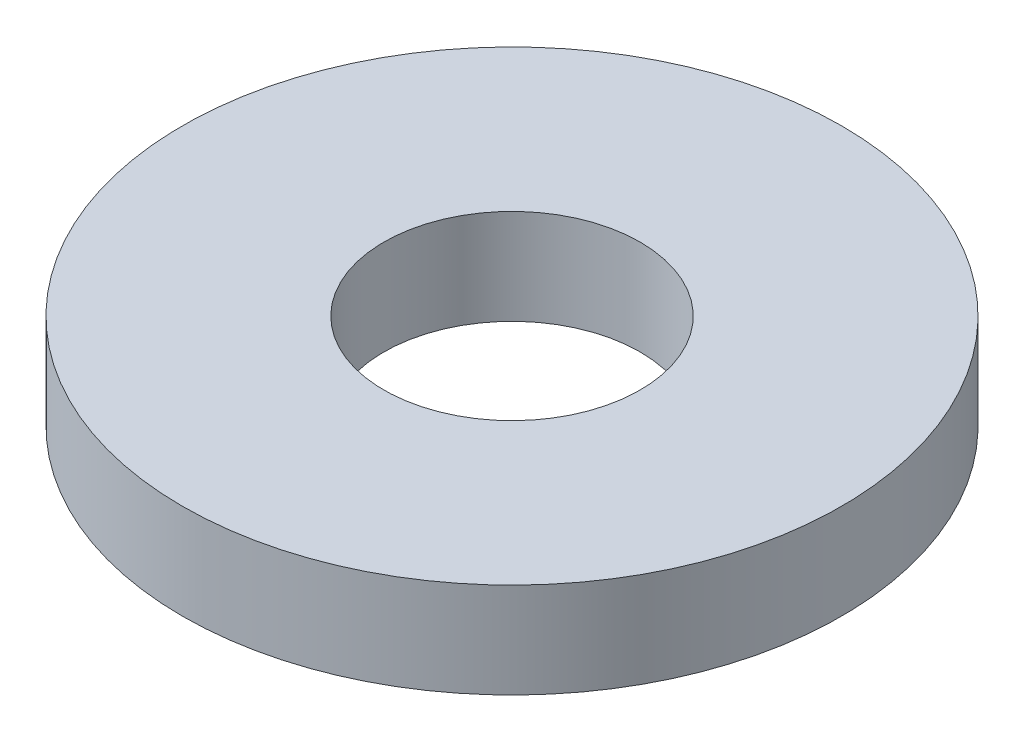
ISO-10303-21;
HEADER;
FILE_DESCRIPTION(('STEP AP214'),'2;1');
FILE_NAME('part.step','',(''),(''),'','','');
FILE_SCHEMA(('AUTOMOTIVE_DESIGN { 1 0 10303 214 1 1 1 1 }'));
ENDSEC;
DATA;
#1=APPLICATION_CONTEXT('core data for automotive mechanical design processes');
#2=APPLICATION_PROTOCOL_DEFINITION('international standard','automotive_design',2000,#1);
#3=PRODUCT_CONTEXT('',#1,'mechanical');
#4=PRODUCT('Part','Part','',(#3));
#5=PRODUCT_RELATED_PRODUCT_CATEGORY('part','',(#4));
#6=PRODUCT_DEFINITION_FORMATION('','',#4);
#7=PRODUCT_DEFINITION_CONTEXT('part definition',#1,'design');
#8=PRODUCT_DEFINITION('design','',#6,#7);
#9=PRODUCT_DEFINITION_SHAPE('','',#8);
#10=(LENGTH_UNIT() NAMED_UNIT(*) SI_UNIT(.MILLI.,.METRE.));
#11=(NAMED_UNIT(*) PLANE_ANGLE_UNIT() SI_UNIT($,.RADIAN.));
#12=(NAMED_UNIT(*) SI_UNIT($,.STERADIAN.) SOLID_ANGLE_UNIT());
#13=UNCERTAINTY_MEASURE_WITH_UNIT(LENGTH_MEASURE(1.E-05),#10,'distance_accuracy_value','');
#14=(GEOMETRIC_REPRESENTATION_CONTEXT(3) GLOBAL_UNCERTAINTY_ASSIGNED_CONTEXT((#13)) GLOBAL_UNIT_ASSIGNED_CONTEXT((#10,
#11,#12)) REPRESENTATION_CONTEXT('',''));
#15=CARTESIAN_POINT('',(0.,0.,0.));
#16=DIRECTION('',(0.,0.,1.));
#17=DIRECTION('',(1.,0.,0.));
#18=AXIS2_PLACEMENT_3D('',#15,#16,#17);
#19=CARTESIAN_POINT('',(0.,26.,0.));
#20=DIRECTION('',(0.,-1.,0.));
#21=DIRECTION('',(0.,0.,-1.));
#22=AXIS2_PLACEMENT_3D('',#19,#20,#21);
#23=CYLINDRICAL_SURFACE('',#22,90.);
#24=CARTESIAN_POINT('',(0.,26.,0.));
#25=DIRECTION('',(0.,1.,0.));
#26=DIRECTION('',(0.,0.,1.));
#27=AXIS2_PLACEMENT_3D('',#24,#25,#26);
#28=CIRCLE('',#27,90.);
#29=CARTESIAN_POINT('',(0.,26.,-90.));
#30=VERTEX_POINT('',#29);
#31=EDGE_CURVE('E10',#30,#30,#28,.T.);
#32=CARTESIAN_POINT('',(0.,0.,0.));
#33=DIRECTION('',(0.,1.,0.));
#34=DIRECTION('',(0.,0.,1.));
#35=AXIS2_PLACEMENT_3D('',#32,#33,#34);
#36=CIRCLE('',#35,90.);
#37=CARTESIAN_POINT('',(0.,0.,-90.));
#38=VERTEX_POINT('',#37);
#39=EDGE_CURVE('E37',#38,#38,#36,.T.);
#40=CARTESIAN_POINT('',(0.,26.,-90.));
#41=CARTESIAN_POINT('',(0.,25.7291666666667,-90.));
#42=CARTESIAN_POINT('',(0.,25.4583333333333,-90.));
#43=CARTESIAN_POINT('',(0.,24.9166666666667,-90.));
#44=CARTESIAN_POINT('',(0.,24.6458333333333,-90.));
#45=CARTESIAN_POINT('',(0.,24.1041666666667,-90.));
#46=CARTESIAN_POINT('',(0.,23.8333333333333,-90.));
#47=CARTESIAN_POINT('',(0.,23.2916666666667,-90.));
#48=CARTESIAN_POINT('',(0.,23.0208333333333,-90.));
#49=CARTESIAN_POINT('',(0.,22.4791666666667,-90.));
#50=CARTESIAN_POINT('',(0.,22.2083333333333,-90.));
#51=CARTESIAN_POINT('',(0.,21.6666666666667,-90.));
#52=CARTESIAN_POINT('',(0.,21.3958333333333,-90.));
#53=CARTESIAN_POINT('',(0.,20.8541666666667,-90.));
#54=CARTESIAN_POINT('',(0.,20.5833333333333,-90.));
#55=CARTESIAN_POINT('',(0.,20.0416666666667,-90.));
#56=CARTESIAN_POINT('',(0.,19.7708333333333,-90.));
#57=CARTESIAN_POINT('',(0.,19.2291666666667,-90.));
#58=CARTESIAN_POINT('',(0.,18.9583333333333,-90.));
#59=CARTESIAN_POINT('',(0.,18.4166666666667,-90.));
#60=CARTESIAN_POINT('',(0.,18.1458333333333,-90.));
#61=CARTESIAN_POINT('',(0.,17.6041666666667,-90.));
#62=CARTESIAN_POINT('',(0.,17.3333333333333,-90.));
#63=CARTESIAN_POINT('',(0.,16.7916666666667,-90.));
#64=CARTESIAN_POINT('',(0.,16.5208333333333,-90.));
#65=CARTESIAN_POINT('',(0.,15.9791666666667,-90.));
#66=CARTESIAN_POINT('',(0.,15.7083333333333,-90.));
#67=CARTESIAN_POINT('',(0.,15.1666666666667,-90.));
#68=CARTESIAN_POINT('',(0.,14.8958333333333,-90.));
#69=CARTESIAN_POINT('',(0.,14.3541666666667,-90.));
#70=CARTESIAN_POINT('',(0.,14.0833333333333,-90.));
#71=CARTESIAN_POINT('',(0.,13.5416666666667,-90.));
#72=CARTESIAN_POINT('',(0.,13.2708333333333,-90.));
#73=CARTESIAN_POINT('',(0.,12.7291666666667,-90.));
#74=CARTESIAN_POINT('',(0.,12.4583333333333,-90.));
#75=CARTESIAN_POINT('',(0.,11.9166666666667,-90.));
#76=CARTESIAN_POINT('',(0.,11.6458333333333,-90.));
#77=CARTESIAN_POINT('',(0.,11.1041666666667,-90.));
#78=CARTESIAN_POINT('',(0.,10.8333333333333,-90.));
#79=CARTESIAN_POINT('',(0.,10.2916666666667,-90.));
#80=CARTESIAN_POINT('',(0.,10.0208333333333,-90.));
#81=CARTESIAN_POINT('',(0.,9.47916666666667,-90.));
#82=CARTESIAN_POINT('',(0.,9.20833333333333,-90.));
#83=CARTESIAN_POINT('',(0.,8.66666666666667,-90.));
#84=CARTESIAN_POINT('',(0.,8.39583333333333,-90.));
#85=CARTESIAN_POINT('',(0.,7.85416666666667,-90.));
#86=CARTESIAN_POINT('',(0.,7.58333333333333,-90.));
#87=CARTESIAN_POINT('',(0.,7.04166666666667,-90.));
#88=CARTESIAN_POINT('',(0.,6.77083333333333,-90.));
#89=CARTESIAN_POINT('',(0.,6.22916666666667,-90.));
#90=CARTESIAN_POINT('',(0.,5.95833333333333,-90.));
#91=CARTESIAN_POINT('',(0.,5.41666666666667,-90.));
#92=CARTESIAN_POINT('',(0.,5.14583333333333,-90.));
#93=CARTESIAN_POINT('',(0.,4.60416666666667,-90.));
#94=CARTESIAN_POINT('',(0.,4.33333333333333,-90.));
#95=CARTESIAN_POINT('',(0.,3.79166666666667,-90.));
#96=CARTESIAN_POINT('',(0.,3.52083333333333,-90.));
#97=CARTESIAN_POINT('',(0.,2.97916666666667,-90.));
#98=CARTESIAN_POINT('',(0.,2.70833333333333,-90.));
#99=CARTESIAN_POINT('',(0.,2.16666666666667,-90.));
#100=CARTESIAN_POINT('',(0.,1.89583333333333,-90.));
#101=CARTESIAN_POINT('',(0.,1.35416666666667,-90.));
#102=CARTESIAN_POINT('',(0.,1.08333333333333,-90.));
#103=CARTESIAN_POINT('',(0.,0.541666666666667,-90.));
#104=CARTESIAN_POINT('',(0.,0.270833333333334,-90.));
#105=CARTESIAN_POINT('',(0.,0.,-90.));
#106=B_SPLINE_CURVE_WITH_KNOTS('',3,(#40,#41,#42,#43,#44,#45,#46,#47,#48,#49,#50,#51,#52,#53,
#54,#55,#56,#57,#58,#59,#60,#61,#62,#63,#64,#65,#66,#67,#68,#69,#70,#71,#72,#73,#74,#75,#76,#77,
#78,#79,#80,#81,#82,#83,#84,#85,#86,#87,#88,#89,#90,#91,#92,#93,#94,#95,#96,#97,#98,#99,#100,
#101,#102,#103,#104,#105),.UNSPECIFIED.,.F.,.F.,(4,2,2,2,2,2,2,2,2,2,2,2,2,2,2,2,2,2,2,2,2,2,2,
2,2,2,2,2,2,2,2,2,4),(0.,0.812500000000001,1.625,2.4375,3.25,4.0625,4.875,5.6875,6.5,7.3125,
8.125,8.9375,9.75,10.5625,11.375,12.1875,13.,13.8125,14.625,15.4375,16.25,17.0625,17.875,
18.6875,19.5,20.3125,21.125,21.9375,22.75,23.5625,24.375,25.1875,26.),.UNSPECIFIED.);
#107=EDGE_CURVE('BSEAM40',#30,#38,#106,.T.);
#108=ORIENTED_EDGE('',*,*,#31,.F.);
#109=ORIENTED_EDGE('',*,*,#39,.T.);
#110=ORIENTED_EDGE('',*,*,#107,.T.);
#111=ORIENTED_EDGE('',*,*,#107,.F.);
#112=EDGE_LOOP('',(#108,#110,#109,#111));
#113=FACE_BOUND('',#112,.T.);
#114=ADVANCED_FACE('F40',(#113),#23,.T.);
#115=CARTESIAN_POINT('',(0.,26.,0.));
#116=DIRECTION('',(0.,1.,0.));
#117=DIRECTION('',(0.,0.,1.));
#118=AXIS2_PLACEMENT_3D('',#115,#116,#117);
#119=PLANE('',#118);
#120=CARTESIAN_POINT('',(0.,26.,0.));
#121=DIRECTION('',(0.,1.,0.));
#122=DIRECTION('',(0.,0.,1.));
#123=AXIS2_PLACEMENT_3D('',#120,#121,#122);
#124=CIRCLE('',#123,35.);
#125=CARTESIAN_POINT('',(0.,26.,-35.));
#126=VERTEX_POINT('',#125);
#127=EDGE_CURVE('E50',#126,#126,#124,.T.);
#128=ORIENTED_EDGE('',*,*,#127,.F.);
#129=EDGE_LOOP('',(#128));
#130=FACE_BOUND('',#129,.T.);
#131=ORIENTED_EDGE('',*,*,#31,.T.);
#132=EDGE_LOOP('',(#131));
#133=FACE_BOUND('',#132,.T.);
#134=ADVANCED_FACE('F59',(#130,#133),#119,.T.);
#135=CARTESIAN_POINT('',(0.,0.,0.));
#136=DIRECTION('',(0.,1.,0.));
#137=DIRECTION('',(0.,0.,1.));
#138=AXIS2_PLACEMENT_3D('',#135,#136,#137);
#139=PLANE('',#138);
#140=CARTESIAN_POINT('',(0.,0.,0.));
#141=DIRECTION('',(0.,1.,0.));
#142=DIRECTION('',(0.,0.,1.));
#143=AXIS2_PLACEMENT_3D('',#140,#141,#142);
#144=CIRCLE('',#143,35.);
#145=CARTESIAN_POINT('',(0.,0.,-35.));
#146=VERTEX_POINT('',#145);
#147=EDGE_CURVE('E47',#146,#146,#144,.T.);
#148=ORIENTED_EDGE('',*,*,#147,.T.);
#149=EDGE_LOOP('',(#148));
#150=FACE_BOUND('',#149,.T.);
#151=ORIENTED_EDGE('',*,*,#39,.F.);
#152=EDGE_LOOP('',(#151));
#153=FACE_BOUND('',#152,.T.);
#154=ADVANCED_FACE('F58',(#150,#153),#139,.F.);
#155=CARTESIAN_POINT('',(0.,26.,0.));
#156=DIRECTION('',(0.,-1.,0.));
#157=DIRECTION('',(0.,0.,-1.));
#158=AXIS2_PLACEMENT_3D('',#155,#156,#157);
#159=CYLINDRICAL_SURFACE('',#158,35.);
#160=CARTESIAN_POINT('',(0.,26.,-35.));
#161=CARTESIAN_POINT('',(0.,25.7291666666667,-35.));
#162=CARTESIAN_POINT('',(0.,25.4583333333333,-35.));
#163=CARTESIAN_POINT('',(0.,24.9166666666667,-35.));
#164=CARTESIAN_POINT('',(0.,24.6458333333333,-35.));
#165=CARTESIAN_POINT('',(0.,24.1041666666667,-35.));
#166=CARTESIAN_POINT('',(0.,23.8333333333333,-35.));
#167=CARTESIAN_POINT('',(0.,23.2916666666667,-35.));
#168=CARTESIAN_POINT('',(0.,23.0208333333333,-35.));
#169=CARTESIAN_POINT('',(0.,22.4791666666667,-35.));
#170=CARTESIAN_POINT('',(0.,22.2083333333333,-35.));
#171=CARTESIAN_POINT('',(0.,21.6666666666667,-35.));
#172=CARTESIAN_POINT('',(0.,21.3958333333333,-35.));
#173=CARTESIAN_POINT('',(0.,20.8541666666667,-35.));
#174=CARTESIAN_POINT('',(0.,20.5833333333333,-35.));
#175=CARTESIAN_POINT('',(0.,20.0416666666667,-35.));
#176=CARTESIAN_POINT('',(0.,19.7708333333333,-35.));
#177=CARTESIAN_POINT('',(0.,19.2291666666667,-35.));
#178=CARTESIAN_POINT('',(0.,18.9583333333333,-35.));
#179=CARTESIAN_POINT('',(0.,18.4166666666667,-35.));
#180=CARTESIAN_POINT('',(0.,18.1458333333333,-35.));
#181=CARTESIAN_POINT('',(0.,17.6041666666667,-35.));
#182=CARTESIAN_POINT('',(0.,17.3333333333333,-35.));
#183=CARTESIAN_POINT('',(0.,16.7916666666667,-35.));
#184=CARTESIAN_POINT('',(0.,16.5208333333333,-35.));
#185=CARTESIAN_POINT('',(0.,15.9791666666667,-35.));
#186=CARTESIAN_POINT('',(0.,15.7083333333333,-35.));
#187=CARTESIAN_POINT('',(0.,15.1666666666667,-35.));
#188=CARTESIAN_POINT('',(0.,14.8958333333333,-35.));
#189=CARTESIAN_POINT('',(0.,14.3541666666667,-35.));
#190=CARTESIAN_POINT('',(0.,14.0833333333333,-35.));
#191=CARTESIAN_POINT('',(0.,13.5416666666667,-35.));
#192=CARTESIAN_POINT('',(0.,13.2708333333333,-35.));
#193=CARTESIAN_POINT('',(0.,12.7291666666667,-35.));
#194=CARTESIAN_POINT('',(0.,12.4583333333333,-35.));
#195=CARTESIAN_POINT('',(0.,11.9166666666667,-35.));
#196=CARTESIAN_POINT('',(0.,11.6458333333333,-35.));
#197=CARTESIAN_POINT('',(0.,11.1041666666667,-35.));
#198=CARTESIAN_POINT('',(0.,10.8333333333333,-35.));
#199=CARTESIAN_POINT('',(0.,10.2916666666667,-35.));
#200=CARTESIAN_POINT('',(0.,10.0208333333333,-35.));
#201=CARTESIAN_POINT('',(0.,9.47916666666667,-35.));
#202=CARTESIAN_POINT('',(0.,9.20833333333333,-35.));
#203=CARTESIAN_POINT('',(0.,8.66666666666667,-35.));
#204=CARTESIAN_POINT('',(0.,8.39583333333333,-35.));
#205=CARTESIAN_POINT('',(0.,7.85416666666667,-35.));
#206=CARTESIAN_POINT('',(0.,7.58333333333333,-35.));
#207=CARTESIAN_POINT('',(0.,7.04166666666667,-35.));
#208=CARTESIAN_POINT('',(0.,6.77083333333333,-35.));
#209=CARTESIAN_POINT('',(0.,6.22916666666667,-35.));
#210=CARTESIAN_POINT('',(0.,5.95833333333333,-35.));
#211=CARTESIAN_POINT('',(0.,5.41666666666667,-35.));
#212=CARTESIAN_POINT('',(0.,5.14583333333333,-35.));
#213=CARTESIAN_POINT('',(0.,4.60416666666667,-35.));
#214=CARTESIAN_POINT('',(0.,4.33333333333333,-35.));
#215=CARTESIAN_POINT('',(0.,3.79166666666667,-35.));
#216=CARTESIAN_POINT('',(0.,3.52083333333333,-35.));
#217=CARTESIAN_POINT('',(0.,2.97916666666667,-35.));
#218=CARTESIAN_POINT('',(0.,2.70833333333333,-35.));
#219=CARTESIAN_POINT('',(0.,2.16666666666667,-35.));
#220=CARTESIAN_POINT('',(0.,1.89583333333333,-35.));
#221=CARTESIAN_POINT('',(0.,1.35416666666667,-35.));
#222=CARTESIAN_POINT('',(0.,1.08333333333333,-35.));
#223=CARTESIAN_POINT('',(0.,0.541666666666667,-35.));
#224=CARTESIAN_POINT('',(0.,0.270833333333334,-35.));
#225=CARTESIAN_POINT('',(0.,0.,-35.));
#226=B_SPLINE_CURVE_WITH_KNOTS('',3,(#160,#161,#162,#163,#164,#165,#166,#167,#168,#169,#170,
#171,#172,#173,#174,#175,#176,#177,#178,#179,#180,#181,#182,#183,#184,#185,#186,#187,#188,#189,
#190,#191,#192,#193,#194,#195,#196,#197,#198,#199,#200,#201,#202,#203,#204,#205,#206,#207,#208,
#209,#210,#211,#212,#213,#214,#215,#216,#217,#218,#219,#220,#221,#222,#223,#224,#225),
.UNSPECIFIED.,.F.,.F.,(4,2,2,2,2,2,2,2,2,2,2,2,2,2,2,2,2,2,2,2,2,2,2,2,2,2,2,2,2,2,2,2,4),(0.,
0.812499999999997,1.625,2.4375,3.25,4.0625,4.875,5.6875,6.5,7.3125,8.125,8.93749999999999,
9.74999999999999,10.5625,11.375,12.1875,13.,13.8125,14.625,15.4375,16.25,17.0625,17.875,18.6875,
19.5,20.3125,21.125,21.9375,22.75,23.5625,24.375,25.1875,26.),.UNSPECIFIED.);
#227=EDGE_CURVE('BSEAM54',#126,#146,#226,.T.);
#228=ORIENTED_EDGE('',*,*,#127,.T.);
#229=ORIENTED_EDGE('',*,*,#147,.F.);
#230=ORIENTED_EDGE('',*,*,#227,.T.);
#231=ORIENTED_EDGE('',*,*,#227,.F.);
#232=EDGE_LOOP('',(#228,#230,#229,#231));
#233=FACE_BOUND('',#232,.T.);
#234=ADVANCED_FACE('F54',(#233),#159,.F.);
#235=CLOSED_SHELL('',(#114,#134,#154,#234));
#236=MANIFOLD_SOLID_BREP('B2',#235);
#237=ADVANCED_BREP_SHAPE_REPRESENTATION('',(#18,#236),#14);
#238=SHAPE_DEFINITION_REPRESENTATION(#9,#237);
ENDSEC;
END-ISO-10303-21;
